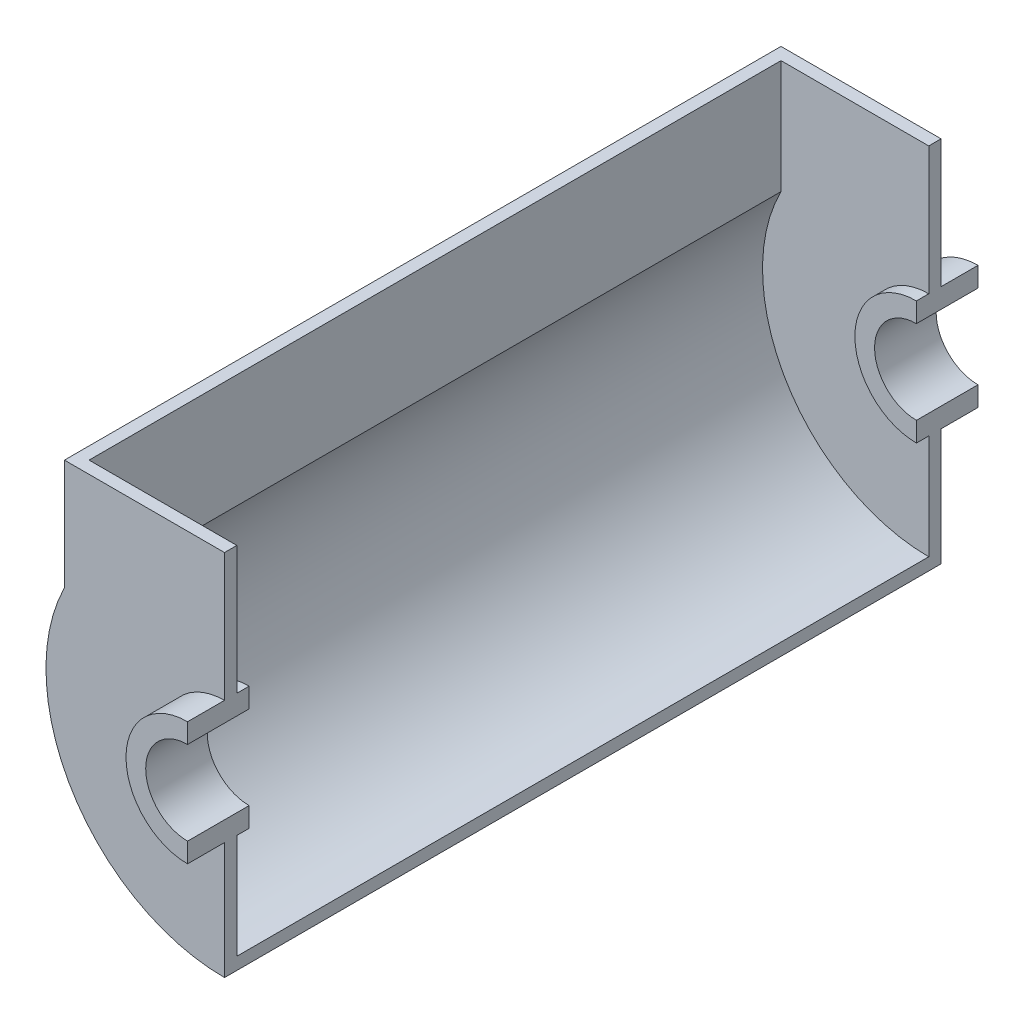
ISO-10303-21;
HEADER;
FILE_DESCRIPTION(('STEP AP214'),'2;1');
FILE_NAME('part.step','',(''),(''),'','','');
FILE_SCHEMA(('AUTOMOTIVE_DESIGN { 1 0 10303 214 1 1 1 1 }'));
ENDSEC;
DATA;
#1=APPLICATION_CONTEXT('core data for automotive mechanical design processes');
#2=APPLICATION_PROTOCOL_DEFINITION('international standard','automotive_design',2000,#1);
#3=PRODUCT_CONTEXT('',#1,'mechanical');
#4=PRODUCT('Part','Part','',(#3));
#5=PRODUCT_RELATED_PRODUCT_CATEGORY('part','',(#4));
#6=PRODUCT_DEFINITION_FORMATION('','',#4);
#7=PRODUCT_DEFINITION_CONTEXT('part definition',#1,'design');
#8=PRODUCT_DEFINITION('design','',#6,#7);
#9=PRODUCT_DEFINITION_SHAPE('','',#8);
#10=(LENGTH_UNIT() NAMED_UNIT(*) SI_UNIT(.MILLI.,.METRE.));
#11=(NAMED_UNIT(*) PLANE_ANGLE_UNIT() SI_UNIT($,.RADIAN.));
#12=(NAMED_UNIT(*) SI_UNIT($,.STERADIAN.) SOLID_ANGLE_UNIT());
#13=UNCERTAINTY_MEASURE_WITH_UNIT(LENGTH_MEASURE(1.E-05),#10,'distance_accuracy_value','');
#14=(GEOMETRIC_REPRESENTATION_CONTEXT(3) GLOBAL_UNCERTAINTY_ASSIGNED_CONTEXT((#13)) GLOBAL_UNIT_ASSIGNED_CONTEXT((#10,
#11,#12)) REPRESENTATION_CONTEXT('',''));
#15=CARTESIAN_POINT('',(0.,0.,0.));
#16=DIRECTION('',(0.,0.,1.));
#17=DIRECTION('',(1.,0.,0.));
#18=AXIS2_PLACEMENT_3D('',#15,#16,#17);
#19=CARTESIAN_POINT('',(0.,0.,0.));
#20=DIRECTION('',(0.,0.,1.));
#21=DIRECTION('',(1.,0.,0.));
#22=AXIS2_PLACEMENT_3D('',#19,#20,#21);
#23=PLANE('',#22);
#24=CARTESIAN_POINT('',(0.,0.,0.));
#25=DIRECTION('',(0.,0.,-1.));
#26=DIRECTION('',(-1.,0.,0.));
#27=AXIS2_PLACEMENT_3D('',#24,#25,#26);
#28=CIRCLE('',#27,67.5);
#29=CARTESIAN_POINT('',(0.,-67.5,0.));
#30=VERTEX_POINT('',#29);
#31=CARTESIAN_POINT('',(-60.,30.9232921921325,0.));
#32=VERTEX_POINT('',#31);
#33=EDGE_CURVE('E241',#30,#32,#28,.T.);
#34=ORIENTED_EDGE('',*,*,#33,.T.);
#35=DIRECTION('',(0.,1.,0.));
#36=VECTOR('',#35,1.);
#37=CARTESIAN_POINT('',(-60.,0.,0.));
#38=LINE('',#37,#36);
#39=CARTESIAN_POINT('',(-60.,77.,0.));
#40=VERTEX_POINT('',#39);
#41=EDGE_CURVE('E51',#32,#40,#38,.T.);
#42=ORIENTED_EDGE('',*,*,#41,.T.);
#43=DIRECTION('',(-1.,0.,0.));
#44=VECTOR('',#43,1.);
#45=CARTESIAN_POINT('',(0.,77.,0.));
#46=LINE('',#45,#44);
#47=CARTESIAN_POINT('',(0.,77.,0.));
#48=VERTEX_POINT('',#47);
#49=EDGE_CURVE('E284',#48,#40,#46,.T.);
#50=ORIENTED_EDGE('',*,*,#49,.F.);
#51=DIRECTION('',(0.,1.,0.));
#52=VECTOR('',#51,1.);
#53=CARTESIAN_POINT('',(0.,25.,0.));
#54=LINE('',#53,#52);
#55=CARTESIAN_POINT('',(0.,25.,0.));
#56=VERTEX_POINT('',#55);
#57=EDGE_CURVE('E282',#56,#48,#54,.T.);
#58=ORIENTED_EDGE('',*,*,#57,.F.);
#59=CARTESIAN_POINT('',(0.,0.,0.));
#60=DIRECTION('',(0.,0.,-1.));
#61=DIRECTION('',(1.,0.,0.));
#62=AXIS2_PLACEMENT_3D('',#59,#60,#61);
#63=CIRCLE('',#62,25.);
#64=CARTESIAN_POINT('',(0.,-25.,0.));
#65=VERTEX_POINT('',#64);
#66=EDGE_CURVE('E266',#65,#56,#63,.T.);
#67=ORIENTED_EDGE('',*,*,#66,.F.);
#68=DIRECTION('',(0.,1.,0.));
#69=VECTOR('',#68,1.);
#70=CARTESIAN_POINT('',(0.,-25.,0.));
#71=LINE('',#70,#69);
#72=EDGE_CURVE('E269',#30,#65,#71,.T.);
#73=ORIENTED_EDGE('',*,*,#72,.F.);
#74=EDGE_LOOP('',(#34,#42,#50,#58,#67,#73));
#75=FACE_BOUND('',#74,.T.);
#76=ADVANCED_FACE('F34',(#75),#23,.F.);
#77=CARTESIAN_POINT('',(0.,0.,-5.));
#78=DIRECTION('',(0.,0.,1.));
#79=DIRECTION('',(1.,0.,0.));
#80=AXIS2_PLACEMENT_3D('',#77,#78,#79);
#81=CYLINDRICAL_SURFACE('',#80,25.);
#82=DIRECTION('',(0.,0.,1.));
#83=VECTOR('',#82,1.);
#84=CARTESIAN_POINT('',(0.,-25.,-5.));
#85=LINE('',#84,#83);
#86=CARTESIAN_POINT('',(0.,-25.,-5.));
#87=VERTEX_POINT('',#86);
#88=EDGE_CURVE('E43',#87,#65,#85,.T.);
#89=ORIENTED_EDGE('',*,*,#88,.T.);
#90=ORIENTED_EDGE('',*,*,#66,.T.);
#91=DIRECTION('',(0.,0.,1.));
#92=VECTOR('',#91,1.);
#93=CARTESIAN_POINT('',(0.,25.,-5.));
#94=LINE('',#93,#92);
#95=CARTESIAN_POINT('',(0.,25.,-5.));
#96=VERTEX_POINT('',#95);
#97=EDGE_CURVE('E321',#96,#56,#94,.T.);
#98=ORIENTED_EDGE('',*,*,#97,.F.);
#99=CARTESIAN_POINT('',(0.,0.,-5.));
#100=DIRECTION('',(0.,0.,1.));
#101=DIRECTION('',(1.,0.,0.));
#102=AXIS2_PLACEMENT_3D('',#99,#100,#101);
#103=CIRCLE('',#102,25.);
#104=EDGE_CURVE('E313',#96,#87,#103,.T.);
#105=ORIENTED_EDGE('',*,*,#104,.T.);
#106=EDGE_LOOP('',(#89,#90,#98,#105));
#107=FACE_BOUND('',#106,.T.);
#108=ADVANCED_FACE('F345',(#107),#81,.T.);
#109=CARTESIAN_POINT('',(0.,0.,-5.));
#110=DIRECTION('',(0.,0.,1.));
#111=DIRECTION('',(1.,0.,0.));
#112=AXIS2_PLACEMENT_3D('',#109,#110,#111);
#113=CYLINDRICAL_SURFACE('',#112,17.);
#114=DIRECTION('',(0.,0.,1.));
#115=VECTOR('',#114,1.);
#116=CARTESIAN_POINT('',(0.,17.,-5.));
#117=LINE('',#116,#115);
#118=CARTESIAN_POINT('',(0.,17.,-5.));
#119=VERTEX_POINT('',#118);
#120=CARTESIAN_POINT('',(0.,17.,20.));
#121=VERTEX_POINT('',#120);
#122=EDGE_CURVE('E38',#119,#121,#117,.T.);
#123=ORIENTED_EDGE('',*,*,#122,.T.);
#124=CARTESIAN_POINT('',(0.,0.,20.));
#125=DIRECTION('',(0.,0.,-1.));
#126=DIRECTION('',(1.,0.,0.));
#127=AXIS2_PLACEMENT_3D('',#124,#125,#126);
#128=CIRCLE('',#127,17.);
#129=CARTESIAN_POINT('',(0.,-17.,20.));
#130=VERTEX_POINT('',#129);
#131=EDGE_CURVE('E295',#130,#121,#128,.T.);
#132=ORIENTED_EDGE('',*,*,#131,.F.);
#133=DIRECTION('',(0.,0.,1.));
#134=VECTOR('',#133,1.);
#135=CARTESIAN_POINT('',(0.,-17.,-5.));
#136=LINE('',#135,#134);
#137=CARTESIAN_POINT('',(0.,-17.,-5.));
#138=VERTEX_POINT('',#137);
#139=EDGE_CURVE('E11',#138,#130,#136,.T.);
#140=ORIENTED_EDGE('',*,*,#139,.F.);
#141=CARTESIAN_POINT('',(0.,0.,-5.));
#142=DIRECTION('',(0.,0.,-1.));
#143=DIRECTION('',(1.,0.,0.));
#144=AXIS2_PLACEMENT_3D('',#141,#142,#143);
#145=CIRCLE('',#144,17.);
#146=EDGE_CURVE('E307',#138,#119,#145,.T.);
#147=ORIENTED_EDGE('',*,*,#146,.T.);
#148=EDGE_LOOP('',(#123,#132,#140,#147));
#149=FACE_BOUND('',#148,.T.);
#150=ADVANCED_FACE('F36',(#149),#113,.F.);
#151=CARTESIAN_POINT('',(0.,-17.,-5.));
#152=DIRECTION('',(1.,0.,0.));
#153=DIRECTION('',(0.,0.,-1.));
#154=AXIS2_PLACEMENT_3D('',#151,#152,#153);
#155=PLANE('',#154);
#156=ORIENTED_EDGE('',*,*,#139,.T.);
#157=DIRECTION('',(0.,1.,0.));
#158=VECTOR('',#157,1.);
#159=CARTESIAN_POINT('',(0.,-17.,20.));
#160=LINE('',#159,#158);
#161=CARTESIAN_POINT('',(0.,-25.,20.));
#162=VERTEX_POINT('',#161);
#163=EDGE_CURVE('E304',#162,#130,#160,.T.);
#164=ORIENTED_EDGE('',*,*,#163,.F.);
#165=CARTESIAN_POINT('',(0.,-25.,5.));
#166=VERTEX_POINT('',#165);
#167=EDGE_CURVE('E320',#166,#162,#85,.T.);
#168=ORIENTED_EDGE('',*,*,#167,.F.);
#169=DIRECTION('',(0.,1.,0.));
#170=VECTOR('',#169,1.);
#171=CARTESIAN_POINT('',(0.,-25.,5.));
#172=LINE('',#171,#170);
#173=CARTESIAN_POINT('',(0.,-72.5,5.));
#174=VERTEX_POINT('',#173);
#175=EDGE_CURVE('E277',#174,#166,#172,.T.);
#176=ORIENTED_EDGE('',*,*,#175,.F.);
#177=DIRECTION('',(0.,0.,-1.));
#178=VECTOR('',#177,1.);
#179=CARTESIAN_POINT('',(0.,-72.5,5.));
#180=LINE('',#179,#178);
#181=CARTESIAN_POINT('',(0.,-72.5,-286.));
#182=VERTEX_POINT('',#181);
#183=EDGE_CURVE('E279',#174,#182,#180,.T.);
#184=ORIENTED_EDGE('',*,*,#183,.T.);
#185=DIRECTION('',(0.,1.,0.));
#186=VECTOR('',#185,1.);
#187=CARTESIAN_POINT('',(0.,-25.,-286.));
#188=LINE('',#187,#186);
#189=CARTESIAN_POINT('',(0.,-25.,-286.));
#190=VERTEX_POINT('',#189);
#191=EDGE_CURVE('E194',#182,#190,#188,.T.);
#192=ORIENTED_EDGE('',*,*,#191,.T.);
#193=DIRECTION('',(0.,0.,-1.));
#194=VECTOR('',#193,1.);
#195=CARTESIAN_POINT('',(0.,-25.,-276.));
#196=LINE('',#195,#194);
#197=CARTESIAN_POINT('',(0.,-25.,-301.));
#198=VERTEX_POINT('',#197);
#199=EDGE_CURVE('E245',#190,#198,#196,.T.);
#200=ORIENTED_EDGE('',*,*,#199,.T.);
#201=DIRECTION('',(0.,1.,0.));
#202=VECTOR('',#201,1.);
#203=CARTESIAN_POINT('',(0.,-17.,-301.));
#204=LINE('',#203,#202);
#205=CARTESIAN_POINT('',(0.,-17.,-301.));
#206=VERTEX_POINT('',#205);
#207=EDGE_CURVE('E225',#198,#206,#204,.T.);
#208=ORIENTED_EDGE('',*,*,#207,.T.);
#209=DIRECTION('',(0.,0.,-1.));
#210=VECTOR('',#209,1.);
#211=CARTESIAN_POINT('',(0.,-17.,-276.));
#212=LINE('',#211,#210);
#213=CARTESIAN_POINT('',(0.,-17.,-276.));
#214=VERTEX_POINT('',#213);
#215=EDGE_CURVE('E238',#214,#206,#212,.T.);
#216=ORIENTED_EDGE('',*,*,#215,.F.);
#217=DIRECTION('',(0.,1.,0.));
#218=VECTOR('',#217,1.);
#219=CARTESIAN_POINT('',(0.,-17.,-276.));
#220=LINE('',#219,#218);
#221=CARTESIAN_POINT('',(0.,-25.,-276.));
#222=VERTEX_POINT('',#221);
#223=EDGE_CURVE('E235',#222,#214,#220,.T.);
#224=ORIENTED_EDGE('',*,*,#223,.F.);
#225=CARTESIAN_POINT('',(0.,-25.,-281.));
#226=VERTEX_POINT('',#225);
#227=EDGE_CURVE('E242',#222,#226,#196,.T.);
#228=ORIENTED_EDGE('',*,*,#227,.T.);
#229=DIRECTION('',(0.,1.,0.));
#230=VECTOR('',#229,1.);
#231=CARTESIAN_POINT('',(0.,-25.,-281.));
#232=LINE('',#231,#230);
#233=CARTESIAN_POINT('',(0.,-67.5,-281.));
#234=VERTEX_POINT('',#233);
#235=EDGE_CURVE('E203',#234,#226,#232,.T.);
#236=ORIENTED_EDGE('',*,*,#235,.F.);
#237=DIRECTION('',(0.,0.,1.));
#238=VECTOR('',#237,1.);
#239=CARTESIAN_POINT('',(0.,-67.5,-447.152038807834));
#240=LINE('',#239,#238);
#241=EDGE_CURVE('E262',#234,#30,#240,.T.);
#242=ORIENTED_EDGE('',*,*,#241,.T.);
#243=ORIENTED_EDGE('',*,*,#72,.T.);
#244=ORIENTED_EDGE('',*,*,#88,.F.);
#245=DIRECTION('',(0.,1.,0.));
#246=VECTOR('',#245,1.);
#247=CARTESIAN_POINT('',(0.,-17.,-5.));
#248=LINE('',#247,#246);
#249=EDGE_CURVE('E316',#87,#138,#248,.T.);
#250=ORIENTED_EDGE('',*,*,#249,.T.);
#251=EDGE_LOOP('',(#156,#164,#168,#176,#184,#192,#200,#208,#216,#224,#228,#236,#242,#243,#244,#250));
#252=FACE_BOUND('',#251,.T.);
#253=ADVANCED_FACE('F338',(#252),#155,.T.);
#254=CARTESIAN_POINT('',(0.,0.,5.));
#255=DIRECTION('',(0.,0.,-1.));
#256=DIRECTION('',(1.,0.,0.));
#257=AXIS2_PLACEMENT_3D('',#254,#255,#256);
#258=CIRCLE('',#257,25.);
#259=CARTESIAN_POINT('',(0.,25.,5.));
#260=VERTEX_POINT('',#259);
#261=EDGE_CURVE('E59',#166,#260,#258,.T.);
#262=ORIENTED_EDGE('',*,*,#261,.F.);
#263=ORIENTED_EDGE('',*,*,#167,.T.);
#264=CARTESIAN_POINT('',(0.,0.,20.));
#265=DIRECTION('',(0.,0.,1.));
#266=DIRECTION('',(1.,0.,0.));
#267=AXIS2_PLACEMENT_3D('',#264,#265,#266);
#268=CIRCLE('',#267,25.);
#269=CARTESIAN_POINT('',(0.,25.,20.));
#270=VERTEX_POINT('',#269);
#271=EDGE_CURVE('E301',#270,#162,#268,.T.);
#272=ORIENTED_EDGE('',*,*,#271,.F.);
#273=EDGE_CURVE('E323',#260,#270,#94,.T.);
#274=ORIENTED_EDGE('',*,*,#273,.F.);
#275=EDGE_LOOP('',(#262,#263,#272,#274));
#276=FACE_BOUND('',#275,.T.);
#277=ADVANCED_FACE('F356',(#276),#81,.T.);
#278=CARTESIAN_POINT('',(0.,25.,-5.));
#279=DIRECTION('',(1.,0.,0.));
#280=DIRECTION('',(0.,0.,-1.));
#281=AXIS2_PLACEMENT_3D('',#278,#279,#280);
#282=PLANE('',#281);
#283=ORIENTED_EDGE('',*,*,#97,.T.);
#284=ORIENTED_EDGE('',*,*,#57,.T.);
#285=DIRECTION('',(0.,0.,-1.));
#286=VECTOR('',#285,1.);
#287=CARTESIAN_POINT('',(0.,77.,5.));
#288=LINE('',#287,#286);
#289=CARTESIAN_POINT('',(0.,77.,5.));
#290=VERTEX_POINT('',#289);
#291=EDGE_CURVE('E292',#290,#48,#288,.T.);
#292=ORIENTED_EDGE('',*,*,#291,.F.);
#293=DIRECTION('',(0.,1.,0.));
#294=VECTOR('',#293,1.);
#295=CARTESIAN_POINT('',(0.,25.,5.));
#296=LINE('',#295,#294);
#297=EDGE_CURVE('E268',#260,#290,#296,.T.);
#298=ORIENTED_EDGE('',*,*,#297,.F.);
#299=ORIENTED_EDGE('',*,*,#273,.T.);
#300=DIRECTION('',(0.,1.,0.));
#301=VECTOR('',#300,1.);
#302=CARTESIAN_POINT('',(0.,25.,20.));
#303=LINE('',#302,#301);
#304=EDGE_CURVE('E298',#121,#270,#303,.T.);
#305=ORIENTED_EDGE('',*,*,#304,.F.);
#306=ORIENTED_EDGE('',*,*,#122,.F.);
#307=DIRECTION('',(0.,1.,0.));
#308=VECTOR('',#307,1.);
#309=CARTESIAN_POINT('',(0.,25.,-5.));
#310=LINE('',#309,#308);
#311=EDGE_CURVE('E310',#119,#96,#310,.T.);
#312=ORIENTED_EDGE('',*,*,#311,.T.);
#313=EDGE_LOOP('',(#283,#284,#292,#298,#299,#305,#306,#312));
#314=FACE_BOUND('',#313,.T.);
#315=ADVANCED_FACE('F331',(#314),#282,.T.);
#316=CARTESIAN_POINT('',(0.,0.,-5.));
#317=DIRECTION('',(0.,0.,1.));
#318=DIRECTION('',(1.,0.,0.));
#319=AXIS2_PLACEMENT_3D('',#316,#317,#318);
#320=PLANE('',#319);
#321=ORIENTED_EDGE('',*,*,#146,.F.);
#322=ORIENTED_EDGE('',*,*,#249,.F.);
#323=ORIENTED_EDGE('',*,*,#104,.F.);
#324=ORIENTED_EDGE('',*,*,#311,.F.);
#325=EDGE_LOOP('',(#321,#322,#323,#324));
#326=FACE_BOUND('',#325,.T.);
#327=ADVANCED_FACE('F342',(#326),#320,.F.);
#328=CARTESIAN_POINT('',(0.,0.,20.));
#329=DIRECTION('',(0.,0.,1.));
#330=DIRECTION('',(1.,0.,0.));
#331=AXIS2_PLACEMENT_3D('',#328,#329,#330);
#332=PLANE('',#331);
#333=ORIENTED_EDGE('',*,*,#131,.T.);
#334=ORIENTED_EDGE('',*,*,#304,.T.);
#335=ORIENTED_EDGE('',*,*,#271,.T.);
#336=ORIENTED_EDGE('',*,*,#163,.T.);
#337=EDGE_LOOP('',(#333,#334,#335,#336));
#338=FACE_BOUND('',#337,.T.);
#339=ADVANCED_FACE('F334',(#338),#332,.T.);
#340=CARTESIAN_POINT('',(0.,77.,5.));
#341=DIRECTION('',(0.,-1.,0.));
#342=DIRECTION('',(1.,0.,0.));
#343=AXIS2_PLACEMENT_3D('',#340,#341,#342);
#344=PLANE('',#343);
#345=ORIENTED_EDGE('',*,*,#49,.T.);
#346=DIRECTION('',(0.,0.,1.));
#347=VECTOR('',#346,1.);
#348=CARTESIAN_POINT('',(-60.,77.,-447.152038807834));
#349=LINE('',#348,#347);
#350=CARTESIAN_POINT('',(-60.,77.,-281.));
#351=VERTEX_POINT('',#350);
#352=EDGE_CURVE('E257',#351,#40,#349,.T.);
#353=ORIENTED_EDGE('',*,*,#352,.F.);
#354=DIRECTION('',(-1.,0.,0.));
#355=VECTOR('',#354,1.);
#356=CARTESIAN_POINT('',(0.,77.,-281.));
#357=LINE('',#356,#355);
#358=CARTESIAN_POINT('',(0.,77.,-281.));
#359=VERTEX_POINT('',#358);
#360=EDGE_CURVE('E190',#359,#351,#357,.T.);
#361=ORIENTED_EDGE('',*,*,#360,.F.);
#362=DIRECTION('',(0.,0.,1.));
#363=VECTOR('',#362,1.);
#364=CARTESIAN_POINT('',(0.,77.,-286.));
#365=LINE('',#364,#363);
#366=CARTESIAN_POINT('',(0.,77.,-286.));
#367=VERTEX_POINT('',#366);
#368=EDGE_CURVE('E186',#367,#359,#365,.T.);
#369=ORIENTED_EDGE('',*,*,#368,.F.);
#370=DIRECTION('',(-1.,0.,0.));
#371=VECTOR('',#370,1.);
#372=CARTESIAN_POINT('',(0.,77.,-286.));
#373=LINE('',#372,#371);
#374=CARTESIAN_POINT('',(-65.,77.,-286.));
#375=VERTEX_POINT('',#374);
#376=EDGE_CURVE('E173',#367,#375,#373,.T.);
#377=ORIENTED_EDGE('',*,*,#376,.T.);
#378=DIRECTION('',(0.,0.,-1.));
#379=VECTOR('',#378,1.);
#380=CARTESIAN_POINT('',(-65.,77.,5.));
#381=LINE('',#380,#379);
#382=CARTESIAN_POINT('',(-65.,77.,5.));
#383=VERTEX_POINT('',#382);
#384=EDGE_CURVE('E290',#383,#375,#381,.T.);
#385=ORIENTED_EDGE('',*,*,#384,.F.);
#386=DIRECTION('',(-1.,0.,0.));
#387=VECTOR('',#386,1.);
#388=CARTESIAN_POINT('',(0.,77.,5.));
#389=LINE('',#388,#387);
#390=EDGE_CURVE('E271',#290,#383,#389,.T.);
#391=ORIENTED_EDGE('',*,*,#390,.F.);
#392=ORIENTED_EDGE('',*,*,#291,.T.);
#393=EDGE_LOOP('',(#345,#353,#361,#369,#377,#385,#391,#392));
#394=FACE_BOUND('',#393,.T.);
#395=ADVANCED_FACE('F188',(#394),#344,.F.);
#396=CARTESIAN_POINT('',(-65.,77.,5.));
#397=DIRECTION('',(1.,0.,0.));
#398=DIRECTION('',(0.,1.,0.));
#399=AXIS2_PLACEMENT_3D('',#396,#397,#398);
#400=PLANE('',#399);
#401=ORIENTED_EDGE('',*,*,#384,.T.);
#402=DIRECTION('',(0.,-1.,0.));
#403=VECTOR('',#402,1.);
#404=CARTESIAN_POINT('',(-65.,77.,-286.));
#405=LINE('',#404,#403);
#406=CARTESIAN_POINT('',(-65.,32.1130814466629,-286.));
#407=VERTEX_POINT('',#406);
#408=EDGE_CURVE('E181',#375,#407,#405,.T.);
#409=ORIENTED_EDGE('',*,*,#408,.T.);
#410=DIRECTION('',(0.,0.,-1.));
#411=VECTOR('',#410,1.);
#412=CARTESIAN_POINT('',(-65.,32.1130814466629,5.));
#413=LINE('',#412,#411);
#414=CARTESIAN_POINT('',(-65.,32.1130814466629,5.));
#415=VERTEX_POINT('',#414);
#416=EDGE_CURVE('E288',#415,#407,#413,.T.);
#417=ORIENTED_EDGE('',*,*,#416,.F.);
#418=DIRECTION('',(0.,-1.,0.));
#419=VECTOR('',#418,1.);
#420=CARTESIAN_POINT('',(-65.,77.,5.));
#421=LINE('',#420,#419);
#422=EDGE_CURVE('E273',#383,#415,#421,.T.);
#423=ORIENTED_EDGE('',*,*,#422,.F.);
#424=EDGE_LOOP('',(#401,#409,#417,#423));
#425=FACE_BOUND('',#424,.T.);
#426=ADVANCED_FACE('F375',(#425),#400,.F.);
#427=CARTESIAN_POINT('',(0.,0.,5.));
#428=DIRECTION('',(0.,0.,-1.));
#429=DIRECTION('',(-1.,0.,0.));
#430=AXIS2_PLACEMENT_3D('',#427,#428,#429);
#431=CYLINDRICAL_SURFACE('',#430,72.5);
#432=ORIENTED_EDGE('',*,*,#416,.T.);
#433=CARTESIAN_POINT('',(0.,0.,-286.));
#434=DIRECTION('',(0.,0.,1.));
#435=DIRECTION('',(1.,0.,0.));
#436=AXIS2_PLACEMENT_3D('',#433,#434,#435);
#437=CIRCLE('',#436,72.5);
#438=EDGE_CURVE('E207',#407,#182,#437,.T.);
#439=ORIENTED_EDGE('',*,*,#438,.T.);
#440=ORIENTED_EDGE('',*,*,#183,.F.);
#441=CARTESIAN_POINT('',(0.,0.,5.));
#442=DIRECTION('',(0.,0.,1.));
#443=DIRECTION('',(1.,0.,0.));
#444=AXIS2_PLACEMENT_3D('',#441,#442,#443);
#445=CIRCLE('',#444,72.5);
#446=EDGE_CURVE('E275',#415,#174,#445,.T.);
#447=ORIENTED_EDGE('',*,*,#446,.F.);
#448=EDGE_LOOP('',(#432,#439,#440,#447));
#449=FACE_BOUND('',#448,.T.);
#450=ADVANCED_FACE('F372',(#449),#431,.T.);
#451=CARTESIAN_POINT('',(0.,0.,5.));
#452=DIRECTION('',(0.,0.,1.));
#453=DIRECTION('',(1.,0.,0.));
#454=AXIS2_PLACEMENT_3D('',#451,#452,#453);
#455=PLANE('',#454);
#456=ORIENTED_EDGE('',*,*,#261,.T.);
#457=ORIENTED_EDGE('',*,*,#297,.T.);
#458=ORIENTED_EDGE('',*,*,#390,.T.);
#459=ORIENTED_EDGE('',*,*,#422,.T.);
#460=ORIENTED_EDGE('',*,*,#446,.T.);
#461=ORIENTED_EDGE('',*,*,#175,.T.);
#462=EDGE_LOOP('',(#456,#457,#458,#459,#460,#461));
#463=FACE_BOUND('',#462,.T.);
#464=ADVANCED_FACE('F353',(#463),#455,.T.);
#465=CARTESIAN_POINT('',(-60.,0.,-447.152038807834));
#466=DIRECTION('',(1.,0.,0.));
#467=DIRECTION('',(0.,0.,-1.));
#468=AXIS2_PLACEMENT_3D('',#465,#466,#467);
#469=PLANE('',#468);
#470=DIRECTION('',(0.,0.,1.));
#471=VECTOR('',#470,1.);
#472=CARTESIAN_POINT('',(-60.,30.9232921921325,-447.152038807834));
#473=LINE('',#472,#471);
#474=CARTESIAN_POINT('',(-60.,30.9232921921325,-281.));
#475=VERTEX_POINT('',#474);
#476=EDGE_CURVE('E261',#475,#32,#473,.T.);
#477=ORIENTED_EDGE('',*,*,#476,.F.);
#478=DIRECTION('',(0.,1.,0.));
#479=VECTOR('',#478,1.);
#480=CARTESIAN_POINT('',(-60.,0.,-281.));
#481=LINE('',#480,#479);
#482=EDGE_CURVE('E252',#475,#351,#481,.T.);
#483=ORIENTED_EDGE('',*,*,#482,.T.);
#484=ORIENTED_EDGE('',*,*,#352,.T.);
#485=ORIENTED_EDGE('',*,*,#41,.F.);
#486=EDGE_LOOP('',(#477,#483,#484,#485));
#487=FACE_BOUND('',#486,.T.);
#488=ADVANCED_FACE('F415',(#487),#469,.T.);
#489=CARTESIAN_POINT('',(0.,0.,-447.152038807834));
#490=DIRECTION('',(0.,0.,1.));
#491=DIRECTION('',(1.,0.,0.));
#492=AXIS2_PLACEMENT_3D('',#489,#490,#491);
#493=CYLINDRICAL_SURFACE('',#492,67.5);
#494=ORIENTED_EDGE('',*,*,#241,.F.);
#495=CARTESIAN_POINT('',(0.,0.,-281.));
#496=DIRECTION('',(0.,0.,-1.));
#497=DIRECTION('',(-1.,0.,0.));
#498=AXIS2_PLACEMENT_3D('',#495,#496,#497);
#499=CIRCLE('',#498,67.5);
#500=EDGE_CURVE('E258',#234,#475,#499,.T.);
#501=ORIENTED_EDGE('',*,*,#500,.T.);
#502=ORIENTED_EDGE('',*,*,#476,.T.);
#503=ORIENTED_EDGE('',*,*,#33,.F.);
#504=EDGE_LOOP('',(#494,#501,#502,#503));
#505=FACE_BOUND('',#504,.T.);
#506=ADVANCED_FACE('F420',(#505),#493,.F.);
#507=CARTESIAN_POINT('',(0.,0.,-281.));
#508=DIRECTION('',(0.,0.,-1.));
#509=DIRECTION('',(1.,0.,0.));
#510=AXIS2_PLACEMENT_3D('',#507,#508,#509);
#511=PLANE('',#510);
#512=ORIENTED_EDGE('',*,*,#482,.F.);
#513=ORIENTED_EDGE('',*,*,#500,.F.);
#514=ORIENTED_EDGE('',*,*,#235,.T.);
#515=CARTESIAN_POINT('',(0.,0.,-281.));
#516=DIRECTION('',(0.,0.,-1.));
#517=DIRECTION('',(1.,0.,0.));
#518=AXIS2_PLACEMENT_3D('',#515,#516,#517);
#519=CIRCLE('',#518,25.);
#520=CARTESIAN_POINT('',(0.,25.,-281.));
#521=VERTEX_POINT('',#520);
#522=EDGE_CURVE('E212',#226,#521,#519,.T.);
#523=ORIENTED_EDGE('',*,*,#522,.T.);
#524=DIRECTION('',(0.,1.,0.));
#525=VECTOR('',#524,1.);
#526=CARTESIAN_POINT('',(0.,25.,-281.));
#527=LINE('',#526,#525);
#528=EDGE_CURVE('E215',#521,#359,#527,.T.);
#529=ORIENTED_EDGE('',*,*,#528,.T.);
#530=ORIENTED_EDGE('',*,*,#360,.T.);
#531=EDGE_LOOP('',(#512,#513,#514,#523,#529,#530));
#532=FACE_BOUND('',#531,.T.);
#533=ADVANCED_FACE('F426',(#532),#511,.F.);
#534=CARTESIAN_POINT('',(0.,0.,-276.));
#535=DIRECTION('',(0.,0.,-1.));
#536=DIRECTION('',(1.,0.,0.));
#537=AXIS2_PLACEMENT_3D('',#534,#535,#536);
#538=CYLINDRICAL_SURFACE('',#537,25.);
#539=ORIENTED_EDGE('',*,*,#227,.F.);
#540=CARTESIAN_POINT('',(0.,0.,-276.));
#541=DIRECTION('',(0.,0.,1.));
#542=DIRECTION('',(1.,0.,0.));
#543=AXIS2_PLACEMENT_3D('',#540,#541,#542);
#544=CIRCLE('',#543,25.);
#545=CARTESIAN_POINT('',(0.,25.,-276.));
#546=VERTEX_POINT('',#545);
#547=EDGE_CURVE('E232',#546,#222,#544,.T.);
#548=ORIENTED_EDGE('',*,*,#547,.F.);
#549=DIRECTION('',(0.,0.,-1.));
#550=VECTOR('',#549,1.);
#551=CARTESIAN_POINT('',(0.,25.,-276.));
#552=LINE('',#551,#550);
#553=EDGE_CURVE('E246',#546,#521,#552,.T.);
#554=ORIENTED_EDGE('',*,*,#553,.T.);
#555=ORIENTED_EDGE('',*,*,#522,.F.);
#556=EDGE_LOOP('',(#539,#548,#554,#555));
#557=FACE_BOUND('',#556,.T.);
#558=ADVANCED_FACE('F434',(#557),#538,.T.);
#559=CARTESIAN_POINT('',(0.,0.,-276.));
#560=DIRECTION('',(0.,0.,-1.));
#561=DIRECTION('',(1.,0.,0.));
#562=AXIS2_PLACEMENT_3D('',#559,#560,#561);
#563=CYLINDRICAL_SURFACE('',#562,17.);
#564=DIRECTION('',(0.,0.,-1.));
#565=VECTOR('',#564,1.);
#566=CARTESIAN_POINT('',(0.,17.,-276.));
#567=LINE('',#566,#565);
#568=CARTESIAN_POINT('',(0.,17.,-276.));
#569=VERTEX_POINT('',#568);
#570=CARTESIAN_POINT('',(0.,17.,-301.));
#571=VERTEX_POINT('',#570);
#572=EDGE_CURVE('E237',#569,#571,#567,.T.);
#573=ORIENTED_EDGE('',*,*,#572,.F.);
#574=CARTESIAN_POINT('',(0.,0.,-276.));
#575=DIRECTION('',(0.,0.,-1.));
#576=DIRECTION('',(1.,0.,0.));
#577=AXIS2_PLACEMENT_3D('',#574,#575,#576);
#578=CIRCLE('',#577,17.);
#579=EDGE_CURVE('E227',#214,#569,#578,.T.);
#580=ORIENTED_EDGE('',*,*,#579,.F.);
#581=ORIENTED_EDGE('',*,*,#215,.T.);
#582=CARTESIAN_POINT('',(0.,0.,-301.));
#583=DIRECTION('',(0.,0.,-1.));
#584=DIRECTION('',(1.,0.,0.));
#585=AXIS2_PLACEMENT_3D('',#582,#583,#584);
#586=CIRCLE('',#585,17.);
#587=EDGE_CURVE('E193',#206,#571,#586,.T.);
#588=ORIENTED_EDGE('',*,*,#587,.T.);
#589=EDGE_LOOP('',(#573,#580,#581,#588));
#590=FACE_BOUND('',#589,.T.);
#591=ADVANCED_FACE('F442',(#590),#563,.F.);
#592=CARTESIAN_POINT('',(0.,0.,-286.));
#593=DIRECTION('',(0.,0.,-1.));
#594=DIRECTION('',(1.,0.,0.));
#595=AXIS2_PLACEMENT_3D('',#592,#593,#594);
#596=CIRCLE('',#595,25.);
#597=CARTESIAN_POINT('',(0.,25.,-286.));
#598=VERTEX_POINT('',#597);
#599=EDGE_CURVE('E201',#190,#598,#596,.T.);
#600=ORIENTED_EDGE('',*,*,#599,.T.);
#601=CARTESIAN_POINT('',(0.,25.,-301.));
#602=VERTEX_POINT('',#601);
#603=EDGE_CURVE('E199',#598,#602,#552,.T.);
#604=ORIENTED_EDGE('',*,*,#603,.T.);
#605=CARTESIAN_POINT('',(0.,0.,-301.));
#606=DIRECTION('',(0.,0.,1.));
#607=DIRECTION('',(1.,0.,0.));
#608=AXIS2_PLACEMENT_3D('',#605,#606,#607);
#609=CIRCLE('',#608,25.);
#610=EDGE_CURVE('E223',#602,#198,#609,.T.);
#611=ORIENTED_EDGE('',*,*,#610,.T.);
#612=ORIENTED_EDGE('',*,*,#199,.F.);
#613=EDGE_LOOP('',(#600,#604,#611,#612));
#614=FACE_BOUND('',#613,.T.);
#615=ADVANCED_FACE('F445',(#614),#538,.T.);
#616=CARTESIAN_POINT('',(0.,25.,-276.));
#617=DIRECTION('',(1.,0.,0.));
#618=DIRECTION('',(0.,0.,1.));
#619=AXIS2_PLACEMENT_3D('',#616,#617,#618);
#620=PLANE('',#619);
#621=ORIENTED_EDGE('',*,*,#553,.F.);
#622=DIRECTION('',(0.,1.,0.));
#623=VECTOR('',#622,1.);
#624=CARTESIAN_POINT('',(0.,25.,-276.));
#625=LINE('',#624,#623);
#626=EDGE_CURVE('E230',#569,#546,#625,.T.);
#627=ORIENTED_EDGE('',*,*,#626,.F.);
#628=ORIENTED_EDGE('',*,*,#572,.T.);
#629=DIRECTION('',(0.,1.,0.));
#630=VECTOR('',#629,1.);
#631=CARTESIAN_POINT('',(0.,25.,-301.));
#632=LINE('',#631,#630);
#633=EDGE_CURVE('E221',#571,#602,#632,.T.);
#634=ORIENTED_EDGE('',*,*,#633,.T.);
#635=ORIENTED_EDGE('',*,*,#603,.F.);
#636=DIRECTION('',(0.,1.,0.));
#637=VECTOR('',#636,1.);
#638=CARTESIAN_POINT('',(0.,25.,-286.));
#639=LINE('',#638,#637);
#640=EDGE_CURVE('E177',#598,#367,#639,.T.);
#641=ORIENTED_EDGE('',*,*,#640,.T.);
#642=ORIENTED_EDGE('',*,*,#368,.T.);
#643=ORIENTED_EDGE('',*,*,#528,.F.);
#644=EDGE_LOOP('',(#621,#627,#628,#634,#635,#641,#642,#643));
#645=FACE_BOUND('',#644,.T.);
#646=ADVANCED_FACE('F197',(#645),#620,.T.);
#647=CARTESIAN_POINT('',(0.,0.,-276.));
#648=DIRECTION('',(0.,0.,-1.));
#649=DIRECTION('',(1.,0.,0.));
#650=AXIS2_PLACEMENT_3D('',#647,#648,#649);
#651=PLANE('',#650);
#652=ORIENTED_EDGE('',*,*,#579,.T.);
#653=ORIENTED_EDGE('',*,*,#626,.T.);
#654=ORIENTED_EDGE('',*,*,#547,.T.);
#655=ORIENTED_EDGE('',*,*,#223,.T.);
#656=EDGE_LOOP('',(#652,#653,#654,#655));
#657=FACE_BOUND('',#656,.T.);
#658=ADVANCED_FACE('F464',(#657),#651,.F.);
#659=CARTESIAN_POINT('',(0.,0.,-301.));
#660=DIRECTION('',(0.,0.,-1.));
#661=DIRECTION('',(1.,0.,0.));
#662=AXIS2_PLACEMENT_3D('',#659,#660,#661);
#663=PLANE('',#662);
#664=ORIENTED_EDGE('',*,*,#587,.F.);
#665=ORIENTED_EDGE('',*,*,#207,.F.);
#666=ORIENTED_EDGE('',*,*,#610,.F.);
#667=ORIENTED_EDGE('',*,*,#633,.F.);
#668=EDGE_LOOP('',(#664,#665,#666,#667));
#669=FACE_BOUND('',#668,.T.);
#670=ADVANCED_FACE('F471',(#669),#663,.T.);
#671=CARTESIAN_POINT('',(0.,0.,-286.));
#672=DIRECTION('',(0.,0.,-1.));
#673=DIRECTION('',(1.,0.,0.));
#674=AXIS2_PLACEMENT_3D('',#671,#672,#673);
#675=PLANE('',#674);
#676=ORIENTED_EDGE('',*,*,#599,.F.);
#677=ORIENTED_EDGE('',*,*,#191,.F.);
#678=ORIENTED_EDGE('',*,*,#438,.F.);
#679=ORIENTED_EDGE('',*,*,#408,.F.);
#680=ORIENTED_EDGE('',*,*,#376,.F.);
#681=ORIENTED_EDGE('',*,*,#640,.F.);
#682=EDGE_LOOP('',(#676,#677,#678,#679,#680,#681));
#683=FACE_BOUND('',#682,.T.);
#684=ADVANCED_FACE('F175',(#683),#675,.T.);
#685=CLOSED_SHELL('',(#76,#108,#150,#253,#277,#315,#327,#339,#395,#426,#450,#464,#488,#506,#533,
#558,#591,#615,#646,#658,#670,#684));
#686=MANIFOLD_SOLID_BREP('B2',#685);
#687=ADVANCED_BREP_SHAPE_REPRESENTATION('',(#18,#686),#14);
#688=SHAPE_DEFINITION_REPRESENTATION(#9,#687);
ENDSEC;
END-ISO-10303-21;
